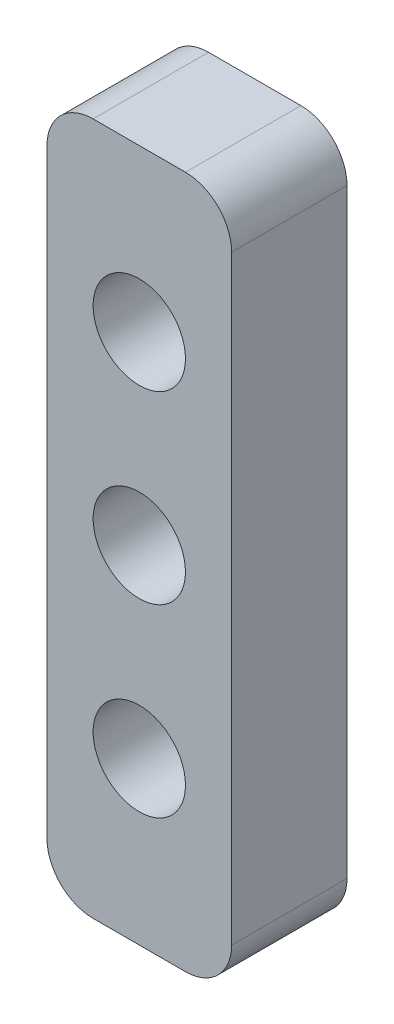
ISO-10303-21;
HEADER;
FILE_DESCRIPTION(('STEP AP214'),'2;1');
FILE_NAME('part.step','',(''),(''),'','','');
FILE_SCHEMA(('AUTOMOTIVE_DESIGN { 1 0 10303 214 1 1 1 1 }'));
ENDSEC;
DATA;
#1=APPLICATION_CONTEXT('core data for automotive mechanical design processes');
#2=APPLICATION_PROTOCOL_DEFINITION('international standard','automotive_design',2000,#1);
#3=PRODUCT_CONTEXT('',#1,'mechanical');
#4=PRODUCT('Part','Part','',(#3));
#5=PRODUCT_RELATED_PRODUCT_CATEGORY('part','',(#4));
#6=PRODUCT_DEFINITION_FORMATION('','',#4);
#7=PRODUCT_DEFINITION_CONTEXT('part definition',#1,'design');
#8=PRODUCT_DEFINITION('design','',#6,#7);
#9=PRODUCT_DEFINITION_SHAPE('','',#8);
#10=(LENGTH_UNIT() NAMED_UNIT(*) SI_UNIT(.MILLI.,.METRE.));
#11=(NAMED_UNIT(*) PLANE_ANGLE_UNIT() SI_UNIT($,.RADIAN.));
#12=(NAMED_UNIT(*) SI_UNIT($,.STERADIAN.) SOLID_ANGLE_UNIT());
#13=UNCERTAINTY_MEASURE_WITH_UNIT(LENGTH_MEASURE(1.E-05),#10,'distance_accuracy_value','');
#14=(GEOMETRIC_REPRESENTATION_CONTEXT(3) GLOBAL_UNCERTAINTY_ASSIGNED_CONTEXT((#13)) GLOBAL_UNIT_ASSIGNED_CONTEXT((#10,
#11,#12)) REPRESENTATION_CONTEXT('',''));
#15=CARTESIAN_POINT('',(0.,0.,0.));
#16=DIRECTION('',(0.,0.,1.));
#17=DIRECTION('',(1.,0.,0.));
#18=AXIS2_PLACEMENT_3D('',#15,#16,#17);
#19=CARTESIAN_POINT('',(5.99999999999999,13.,5.));
#20=DIRECTION('',(0.,0.,-1.));
#21=DIRECTION('',(-1.,0.,0.));
#22=AXIS2_PLACEMENT_3D('',#19,#20,#21);
#23=CYLINDRICAL_SURFACE('',#22,2.);
#24=CARTESIAN_POINT('',(5.99999999999999,13.,0.));
#25=DIRECTION('',(0.,0.,1.));
#26=DIRECTION('',(1.,0.,0.));
#27=AXIS2_PLACEMENT_3D('',#24,#25,#26);
#28=CIRCLE('',#27,2.);
#29=CARTESIAN_POINT('',(7.99999999999999,13.,0.));
#30=VERTEX_POINT('',#29);
#31=CARTESIAN_POINT('',(6.,15.,0.));
#32=VERTEX_POINT('',#31);
#33=EDGE_CURVE('E133',#30,#32,#28,.T.);
#34=ORIENTED_EDGE('',*,*,#33,.T.);
#35=DIRECTION('',(0.,0.,-1.));
#36=VECTOR('',#35,1.);
#37=CARTESIAN_POINT('',(6.,15.,5.));
#38=LINE('',#37,#36);
#39=CARTESIAN_POINT('',(6.,15.,5.));
#40=VERTEX_POINT('',#39);
#41=EDGE_CURVE('E11',#40,#32,#38,.T.);
#42=ORIENTED_EDGE('',*,*,#41,.F.);
#43=CARTESIAN_POINT('',(5.99999999999999,13.,5.));
#44=DIRECTION('',(0.,0.,1.));
#45=DIRECTION('',(1.,0.,0.));
#46=AXIS2_PLACEMENT_3D('',#43,#44,#45);
#47=CIRCLE('',#46,2.);
#48=CARTESIAN_POINT('',(7.99999999999999,13.,5.));
#49=VERTEX_POINT('',#48);
#50=EDGE_CURVE('E148',#49,#40,#47,.T.);
#51=ORIENTED_EDGE('',*,*,#50,.F.);
#52=DIRECTION('',(0.,0.,-1.));
#53=VECTOR('',#52,1.);
#54=CARTESIAN_POINT('',(7.99999999999999,13.,5.));
#55=LINE('',#54,#53);
#56=EDGE_CURVE('E129',#49,#30,#55,.T.);
#57=ORIENTED_EDGE('',*,*,#56,.T.);
#58=EDGE_LOOP('',(#34,#42,#51,#57));
#59=FACE_BOUND('',#58,.T.);
#60=ADVANCED_FACE('F37',(#59),#23,.T.);
#61=CARTESIAN_POINT('',(2.,15.,5.));
#62=DIRECTION('',(0.,-1.,0.));
#63=DIRECTION('',(1.,0.,0.));
#64=AXIS2_PLACEMENT_3D('',#61,#62,#63);
#65=PLANE('',#64);
#66=DIRECTION('',(-1.,0.,0.));
#67=VECTOR('',#66,1.);
#68=CARTESIAN_POINT('',(2.,15.,0.));
#69=LINE('',#68,#67);
#70=CARTESIAN_POINT('',(2.,15.,0.));
#71=VERTEX_POINT('',#70);
#72=EDGE_CURVE('E136',#32,#71,#69,.T.);
#73=ORIENTED_EDGE('',*,*,#72,.T.);
#74=DIRECTION('',(0.,0.,-1.));
#75=VECTOR('',#74,1.);
#76=CARTESIAN_POINT('',(2.,15.,5.));
#77=LINE('',#76,#75);
#78=CARTESIAN_POINT('',(2.,15.,5.));
#79=VERTEX_POINT('',#78);
#80=EDGE_CURVE('E45',#79,#71,#77,.T.);
#81=ORIENTED_EDGE('',*,*,#80,.F.);
#82=DIRECTION('',(-1.,0.,0.));
#83=VECTOR('',#82,1.);
#84=CARTESIAN_POINT('',(2.,15.,5.));
#85=LINE('',#84,#83);
#86=EDGE_CURVE('E96',#40,#79,#85,.T.);
#87=ORIENTED_EDGE('',*,*,#86,.F.);
#88=ORIENTED_EDGE('',*,*,#41,.T.);
#89=EDGE_LOOP('',(#73,#81,#87,#88));
#90=FACE_BOUND('',#89,.T.);
#91=ADVANCED_FACE('F224',(#90),#65,.F.);
#92=CARTESIAN_POINT('',(2.,13.,5.));
#93=DIRECTION('',(0.,0.,-1.));
#94=DIRECTION('',(-1.,0.,0.));
#95=AXIS2_PLACEMENT_3D('',#92,#93,#94);
#96=CYLINDRICAL_SURFACE('',#95,2.);
#97=CARTESIAN_POINT('',(2.,13.,0.));
#98=DIRECTION('',(0.,0.,1.));
#99=DIRECTION('',(-1.,0.,0.));
#100=AXIS2_PLACEMENT_3D('',#97,#98,#99);
#101=CIRCLE('',#100,2.);
#102=CARTESIAN_POINT('',(0.,13.,0.));
#103=VERTEX_POINT('',#102);
#104=EDGE_CURVE('E139',#71,#103,#101,.T.);
#105=ORIENTED_EDGE('',*,*,#104,.T.);
#106=DIRECTION('',(0.,0.,-1.));
#107=VECTOR('',#106,1.);
#108=CARTESIAN_POINT('',(0.,13.,5.));
#109=LINE('',#108,#107);
#110=CARTESIAN_POINT('',(0.,13.,5.));
#111=VERTEX_POINT('',#110);
#112=EDGE_CURVE('E155',#111,#103,#109,.T.);
#113=ORIENTED_EDGE('',*,*,#112,.F.);
#114=CARTESIAN_POINT('',(2.,13.,5.));
#115=DIRECTION('',(0.,0.,1.));
#116=DIRECTION('',(-1.,0.,0.));
#117=AXIS2_PLACEMENT_3D('',#114,#115,#116);
#118=CIRCLE('',#117,2.);
#119=EDGE_CURVE('E163',#79,#111,#118,.T.);
#120=ORIENTED_EDGE('',*,*,#119,.F.);
#121=ORIENTED_EDGE('',*,*,#80,.T.);
#122=EDGE_LOOP('',(#105,#113,#120,#121));
#123=FACE_BOUND('',#122,.T.);
#124=ADVANCED_FACE('F161',(#123),#96,.T.);
#125=CARTESIAN_POINT('',(0.,-13.,5.));
#126=DIRECTION('',(1.,0.,0.));
#127=DIRECTION('',(0.,1.,0.));
#128=AXIS2_PLACEMENT_3D('',#125,#126,#127);
#129=PLANE('',#128);
#130=DIRECTION('',(0.,-1.,0.));
#131=VECTOR('',#130,1.);
#132=CARTESIAN_POINT('',(0.,-13.,0.));
#133=LINE('',#132,#131);
#134=CARTESIAN_POINT('',(0.,-13.,0.));
#135=VERTEX_POINT('',#134);
#136=EDGE_CURVE('E141',#103,#135,#133,.T.);
#137=ORIENTED_EDGE('',*,*,#136,.T.);
#138=DIRECTION('',(0.,0.,-1.));
#139=VECTOR('',#138,1.);
#140=CARTESIAN_POINT('',(0.,-13.,5.));
#141=LINE('',#140,#139);
#142=CARTESIAN_POINT('',(0.,-13.,5.));
#143=VERTEX_POINT('',#142);
#144=EDGE_CURVE('E152',#143,#135,#141,.T.);
#145=ORIENTED_EDGE('',*,*,#144,.F.);
#146=DIRECTION('',(0.,-1.,0.));
#147=VECTOR('',#146,1.);
#148=CARTESIAN_POINT('',(0.,-13.,5.));
#149=LINE('',#148,#147);
#150=EDGE_CURVE('E175',#111,#143,#149,.T.);
#151=ORIENTED_EDGE('',*,*,#150,.F.);
#152=ORIENTED_EDGE('',*,*,#112,.T.);
#153=EDGE_LOOP('',(#137,#145,#151,#152));
#154=FACE_BOUND('',#153,.T.);
#155=ADVANCED_FACE('F171',(#154),#129,.F.);
#156=CARTESIAN_POINT('',(2.,-13.,5.));
#157=DIRECTION('',(0.,0.,-1.));
#158=DIRECTION('',(-1.,0.,0.));
#159=AXIS2_PLACEMENT_3D('',#156,#157,#158);
#160=CYLINDRICAL_SURFACE('',#159,2.);
#161=CARTESIAN_POINT('',(2.,-13.,0.));
#162=DIRECTION('',(0.,0.,1.));
#163=DIRECTION('',(1.,0.,0.));
#164=AXIS2_PLACEMENT_3D('',#161,#162,#163);
#165=CIRCLE('',#164,2.);
#166=CARTESIAN_POINT('',(2.,-15.,0.));
#167=VERTEX_POINT('',#166);
#168=EDGE_CURVE('E143',#135,#167,#165,.T.);
#169=ORIENTED_EDGE('',*,*,#168,.T.);
#170=DIRECTION('',(0.,0.,-1.));
#171=VECTOR('',#170,1.);
#172=CARTESIAN_POINT('',(2.,-15.,5.));
#173=LINE('',#172,#171);
#174=CARTESIAN_POINT('',(2.,-15.,5.));
#175=VERTEX_POINT('',#174);
#176=EDGE_CURVE('E124',#175,#167,#173,.T.);
#177=ORIENTED_EDGE('',*,*,#176,.F.);
#178=CARTESIAN_POINT('',(2.,-13.,5.));
#179=DIRECTION('',(0.,0.,1.));
#180=DIRECTION('',(1.,0.,0.));
#181=AXIS2_PLACEMENT_3D('',#178,#179,#180);
#182=CIRCLE('',#181,2.);
#183=EDGE_CURVE('E115',#143,#175,#182,.T.);
#184=ORIENTED_EDGE('',*,*,#183,.F.);
#185=ORIENTED_EDGE('',*,*,#144,.T.);
#186=EDGE_LOOP('',(#169,#177,#184,#185));
#187=FACE_BOUND('',#186,.T.);
#188=ADVANCED_FACE('F174',(#187),#160,.T.);
#189=CARTESIAN_POINT('',(2.,-15.,5.));
#190=DIRECTION('',(0.,1.,0.));
#191=DIRECTION('',(-1.,0.,0.));
#192=AXIS2_PLACEMENT_3D('',#189,#190,#191);
#193=PLANE('',#192);
#194=DIRECTION('',(1.,0.,0.));
#195=VECTOR('',#194,1.);
#196=CARTESIAN_POINT('',(2.,-15.,0.));
#197=LINE('',#196,#195);
#198=CARTESIAN_POINT('',(6.,-15.,0.));
#199=VERTEX_POINT('',#198);
#200=EDGE_CURVE('E123',#167,#199,#197,.T.);
#201=ORIENTED_EDGE('',*,*,#200,.T.);
#202=DIRECTION('',(0.,0.,-1.));
#203=VECTOR('',#202,1.);
#204=CARTESIAN_POINT('',(6.,-15.,5.));
#205=LINE('',#204,#203);
#206=CARTESIAN_POINT('',(6.,-15.,5.));
#207=VERTEX_POINT('',#206);
#208=EDGE_CURVE('E120',#207,#199,#205,.T.);
#209=ORIENTED_EDGE('',*,*,#208,.F.);
#210=DIRECTION('',(1.,0.,0.));
#211=VECTOR('',#210,1.);
#212=CARTESIAN_POINT('',(2.,-15.,5.));
#213=LINE('',#212,#211);
#214=EDGE_CURVE('E109',#175,#207,#213,.T.);
#215=ORIENTED_EDGE('',*,*,#214,.F.);
#216=ORIENTED_EDGE('',*,*,#176,.T.);
#217=EDGE_LOOP('',(#201,#209,#215,#216));
#218=FACE_BOUND('',#217,.T.);
#219=ADVANCED_FACE('F121',(#218),#193,.F.);
#220=CARTESIAN_POINT('',(6.,-13.,5.));
#221=DIRECTION('',(0.,0.,-1.));
#222=DIRECTION('',(-1.,0.,0.));
#223=AXIS2_PLACEMENT_3D('',#220,#221,#222);
#224=CYLINDRICAL_SURFACE('',#223,2.);
#225=CARTESIAN_POINT('',(6.,-13.,0.));
#226=DIRECTION('',(0.,0.,1.));
#227=DIRECTION('',(-1.,0.,0.));
#228=AXIS2_PLACEMENT_3D('',#225,#226,#227);
#229=CIRCLE('',#228,2.);
#230=CARTESIAN_POINT('',(8.,-13.,0.));
#231=VERTEX_POINT('',#230);
#232=EDGE_CURVE('E82',#199,#231,#229,.T.);
#233=ORIENTED_EDGE('',*,*,#232,.T.);
#234=DIRECTION('',(0.,0.,-1.));
#235=VECTOR('',#234,1.);
#236=CARTESIAN_POINT('',(8.,-13.,5.));
#237=LINE('',#236,#235);
#238=CARTESIAN_POINT('',(8.,-13.,5.));
#239=VERTEX_POINT('',#238);
#240=EDGE_CURVE('E125',#239,#231,#237,.T.);
#241=ORIENTED_EDGE('',*,*,#240,.F.);
#242=CARTESIAN_POINT('',(6.,-13.,5.));
#243=DIRECTION('',(0.,0.,1.));
#244=DIRECTION('',(-1.,0.,0.));
#245=AXIS2_PLACEMENT_3D('',#242,#243,#244);
#246=CIRCLE('',#245,2.);
#247=EDGE_CURVE('E113',#207,#239,#246,.T.);
#248=ORIENTED_EDGE('',*,*,#247,.F.);
#249=ORIENTED_EDGE('',*,*,#208,.T.);
#250=EDGE_LOOP('',(#233,#241,#248,#249));
#251=FACE_BOUND('',#250,.T.);
#252=ADVANCED_FACE('F127',(#251),#224,.T.);
#253=CARTESIAN_POINT('',(8.,-13.,5.));
#254=DIRECTION('',(-1.,0.,0.));
#255=DIRECTION('',(0.,-1.,0.));
#256=AXIS2_PLACEMENT_3D('',#253,#254,#255);
#257=PLANE('',#256);
#258=DIRECTION('',(0.,1.,0.));
#259=VECTOR('',#258,1.);
#260=CARTESIAN_POINT('',(8.,-13.,0.));
#261=LINE('',#260,#259);
#262=EDGE_CURVE('E88',#231,#30,#261,.T.);
#263=ORIENTED_EDGE('',*,*,#262,.T.);
#264=ORIENTED_EDGE('',*,*,#56,.F.);
#265=DIRECTION('',(0.,1.,0.));
#266=VECTOR('',#265,1.);
#267=CARTESIAN_POINT('',(8.,-13.,5.));
#268=LINE('',#267,#266);
#269=EDGE_CURVE('E53',#239,#49,#268,.T.);
#270=ORIENTED_EDGE('',*,*,#269,.F.);
#271=ORIENTED_EDGE('',*,*,#240,.T.);
#272=EDGE_LOOP('',(#263,#264,#270,#271));
#273=FACE_BOUND('',#272,.T.);
#274=ADVANCED_FACE('F203',(#273),#257,.F.);
#275=CARTESIAN_POINT('',(5.99999999999999,13.,5.));
#276=DIRECTION('',(0.,0.,1.));
#277=DIRECTION('',(1.,0.,0.));
#278=AXIS2_PLACEMENT_3D('',#275,#276,#277);
#279=PLANE('',#278);
#280=CARTESIAN_POINT('',(4.,-8.,5.));
#281=DIRECTION('',(0.,0.,1.));
#282=DIRECTION('',(1.,0.,0.));
#283=AXIS2_PLACEMENT_3D('',#280,#281,#282);
#284=CIRCLE('',#283,2.);
#285=CARTESIAN_POINT('',(6.,-8.,5.));
#286=VERTEX_POINT('',#285);
#287=EDGE_CURVE('E190',#286,#286,#284,.T.);
#288=ORIENTED_EDGE('',*,*,#287,.F.);
#289=EDGE_LOOP('',(#288));
#290=FACE_BOUND('',#289,.T.);
#291=CARTESIAN_POINT('',(4.,8.,5.));
#292=DIRECTION('',(0.,0.,1.));
#293=DIRECTION('',(1.,0.,0.));
#294=AXIS2_PLACEMENT_3D('',#291,#292,#293);
#295=CIRCLE('',#294,2.);
#296=CARTESIAN_POINT('',(6.,8.,5.));
#297=VERTEX_POINT('',#296);
#298=EDGE_CURVE('E184',#297,#297,#295,.T.);
#299=ORIENTED_EDGE('',*,*,#298,.F.);
#300=EDGE_LOOP('',(#299));
#301=FACE_BOUND('',#300,.T.);
#302=CARTESIAN_POINT('',(4.,0.,5.));
#303=DIRECTION('',(0.,0.,1.));
#304=DIRECTION('',(1.,0.,0.));
#305=AXIS2_PLACEMENT_3D('',#302,#303,#304);
#306=CIRCLE('',#305,2.);
#307=CARTESIAN_POINT('',(6.,0.,5.));
#308=VERTEX_POINT('',#307);
#309=EDGE_CURVE('E181',#308,#308,#306,.T.);
#310=ORIENTED_EDGE('',*,*,#309,.F.);
#311=EDGE_LOOP('',(#310));
#312=FACE_BOUND('',#311,.T.);
#313=ORIENTED_EDGE('',*,*,#50,.T.);
#314=ORIENTED_EDGE('',*,*,#86,.T.);
#315=ORIENTED_EDGE('',*,*,#119,.T.);
#316=ORIENTED_EDGE('',*,*,#150,.T.);
#317=ORIENTED_EDGE('',*,*,#183,.T.);
#318=ORIENTED_EDGE('',*,*,#214,.T.);
#319=ORIENTED_EDGE('',*,*,#247,.T.);
#320=ORIENTED_EDGE('',*,*,#269,.T.);
#321=EDGE_LOOP('',(#313,#314,#315,#316,#317,#318,#319,#320));
#322=FACE_BOUND('',#321,.T.);
#323=ADVANCED_FACE('F111',(#290,#301,#312,#322),#279,.T.);
#324=CARTESIAN_POINT('',(5.99999999999999,13.,0.));
#325=DIRECTION('',(0.,0.,1.));
#326=DIRECTION('',(1.,0.,0.));
#327=AXIS2_PLACEMENT_3D('',#324,#325,#326);
#328=PLANE('',#327);
#329=CARTESIAN_POINT('',(4.,-8.,0.));
#330=DIRECTION('',(0.,0.,1.));
#331=DIRECTION('',(1.,0.,0.));
#332=AXIS2_PLACEMENT_3D('',#329,#330,#331);
#333=CIRCLE('',#332,2.);
#334=CARTESIAN_POINT('',(6.,-8.,0.));
#335=VERTEX_POINT('',#334);
#336=EDGE_CURVE('E187',#335,#335,#333,.T.);
#337=ORIENTED_EDGE('',*,*,#336,.T.);
#338=EDGE_LOOP('',(#337));
#339=FACE_BOUND('',#338,.T.);
#340=CARTESIAN_POINT('',(4.,8.,0.));
#341=DIRECTION('',(0.,0.,1.));
#342=DIRECTION('',(1.,0.,0.));
#343=AXIS2_PLACEMENT_3D('',#340,#341,#342);
#344=CIRCLE('',#343,2.);
#345=CARTESIAN_POINT('',(6.,8.,0.));
#346=VERTEX_POINT('',#345);
#347=EDGE_CURVE('E193',#346,#346,#344,.T.);
#348=ORIENTED_EDGE('',*,*,#347,.T.);
#349=EDGE_LOOP('',(#348));
#350=FACE_BOUND('',#349,.T.);
#351=CARTESIAN_POINT('',(4.,0.,0.));
#352=DIRECTION('',(0.,0.,1.));
#353=DIRECTION('',(1.,0.,0.));
#354=AXIS2_PLACEMENT_3D('',#351,#352,#353);
#355=CIRCLE('',#354,2.);
#356=CARTESIAN_POINT('',(6.,0.,0.));
#357=VERTEX_POINT('',#356);
#358=EDGE_CURVE('E137',#357,#357,#355,.T.);
#359=ORIENTED_EDGE('',*,*,#358,.T.);
#360=EDGE_LOOP('',(#359));
#361=FACE_BOUND('',#360,.T.);
#362=ORIENTED_EDGE('',*,*,#33,.F.);
#363=ORIENTED_EDGE('',*,*,#262,.F.);
#364=ORIENTED_EDGE('',*,*,#232,.F.);
#365=ORIENTED_EDGE('',*,*,#200,.F.);
#366=ORIENTED_EDGE('',*,*,#168,.F.);
#367=ORIENTED_EDGE('',*,*,#136,.F.);
#368=ORIENTED_EDGE('',*,*,#104,.F.);
#369=ORIENTED_EDGE('',*,*,#72,.F.);
#370=EDGE_LOOP('',(#362,#363,#364,#365,#366,#367,#368,#369));
#371=FACE_BOUND('',#370,.T.);
#372=ADVANCED_FACE('F167',(#339,#350,#361,#371),#328,.F.);
#373=CARTESIAN_POINT('',(4.,0.,0.));
#374=DIRECTION('',(0.,0.,1.));
#375=DIRECTION('',(1.,0.,0.));
#376=AXIS2_PLACEMENT_3D('',#373,#374,#375);
#377=CYLINDRICAL_SURFACE('',#376,2.);
#378=ORIENTED_EDGE('',*,*,#358,.F.);
#379=EDGE_LOOP('',(#378));
#380=FACE_BOUND('',#379,.T.);
#381=ORIENTED_EDGE('',*,*,#309,.T.);
#382=EDGE_LOOP('',(#381));
#383=FACE_BOUND('',#382,.T.);
#384=ADVANCED_FACE('F208',(#380,#383),#377,.F.);
#385=CARTESIAN_POINT('',(4.,8.,0.));
#386=DIRECTION('',(0.,0.,1.));
#387=DIRECTION('',(1.,0.,0.));
#388=AXIS2_PLACEMENT_3D('',#385,#386,#387);
#389=CYLINDRICAL_SURFACE('',#388,2.);
#390=ORIENTED_EDGE('',*,*,#347,.F.);
#391=EDGE_LOOP('',(#390));
#392=FACE_BOUND('',#391,.T.);
#393=ORIENTED_EDGE('',*,*,#298,.T.);
#394=EDGE_LOOP('',(#393));
#395=FACE_BOUND('',#394,.T.);
#396=ADVANCED_FACE('F199',(#392,#395),#389,.F.);
#397=CARTESIAN_POINT('',(4.,-8.,0.));
#398=DIRECTION('',(0.,0.,1.));
#399=DIRECTION('',(1.,0.,0.));
#400=AXIS2_PLACEMENT_3D('',#397,#398,#399);
#401=CYLINDRICAL_SURFACE('',#400,2.);
#402=ORIENTED_EDGE('',*,*,#336,.F.);
#403=EDGE_LOOP('',(#402));
#404=FACE_BOUND('',#403,.T.);
#405=ORIENTED_EDGE('',*,*,#287,.T.);
#406=EDGE_LOOP('',(#405));
#407=FACE_BOUND('',#406,.T.);
#408=ADVANCED_FACE('F216',(#404,#407),#401,.F.);
#409=CLOSED_SHELL('',(#60,#91,#124,#155,#188,#219,#252,#274,#323,#372,#384,#396,#408));
#410=MANIFOLD_SOLID_BREP('B2',#409);
#411=ADVANCED_BREP_SHAPE_REPRESENTATION('',(#18,#410),#14);
#412=SHAPE_DEFINITION_REPRESENTATION(#9,#411);
ENDSEC;
END-ISO-10303-21;
